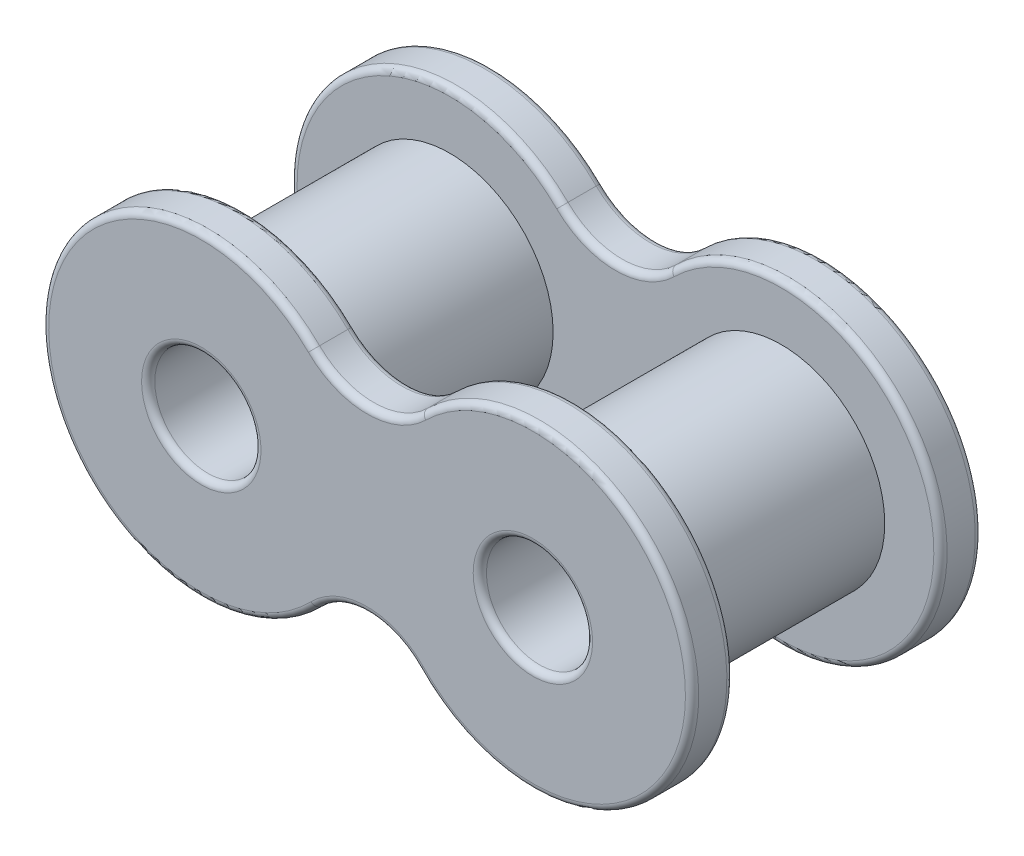
ISO-10303-21;
HEADER;
FILE_DESCRIPTION(('STEP AP214'),'2;1');
FILE_NAME('part.step','',(''),(''),'','','');
FILE_SCHEMA(('AUTOMOTIVE_DESIGN { 1 0 10303 214 1 1 1 1 }'));
ENDSEC;
DATA;
#1=APPLICATION_CONTEXT('core data for automotive mechanical design processes');
#2=APPLICATION_PROTOCOL_DEFINITION('international standard','automotive_design',2000,#1);
#3=PRODUCT_CONTEXT('',#1,'mechanical');
#4=PRODUCT('Part','Part','',(#3));
#5=PRODUCT_RELATED_PRODUCT_CATEGORY('part','',(#4));
#6=PRODUCT_DEFINITION_FORMATION('','',#4);
#7=PRODUCT_DEFINITION_CONTEXT('part definition',#1,'design');
#8=PRODUCT_DEFINITION('design','',#6,#7);
#9=PRODUCT_DEFINITION_SHAPE('','',#8);
#10=(LENGTH_UNIT() NAMED_UNIT(*) SI_UNIT(.MILLI.,.METRE.));
#11=(NAMED_UNIT(*) PLANE_ANGLE_UNIT() SI_UNIT($,.RADIAN.));
#12=(NAMED_UNIT(*) SI_UNIT($,.STERADIAN.) SOLID_ANGLE_UNIT());
#13=UNCERTAINTY_MEASURE_WITH_UNIT(LENGTH_MEASURE(1.E-05),#10,'distance_accuracy_value','');
#14=(GEOMETRIC_REPRESENTATION_CONTEXT(3) GLOBAL_UNCERTAINTY_ASSIGNED_CONTEXT((#13)) GLOBAL_UNIT_ASSIGNED_CONTEXT((#10,
#11,#12)) REPRESENTATION_CONTEXT('',''));
#15=CARTESIAN_POINT('',(0.,0.,0.));
#16=DIRECTION('',(0.,0.,1.));
#17=DIRECTION('',(1.,0.,0.));
#18=AXIS2_PLACEMENT_3D('',#15,#16,#17);
#19=CARTESIAN_POINT('',(3.175,3.22195909555123,1.5875));
#20=DIRECTION('',(0.,0.,1.));
#21=DIRECTION('',(1.,0.,0.));
#22=AXIS2_PLACEMENT_3D('',#19,#20,#21);
#23=PLANE('',#22);
#24=CARTESIAN_POINT('',(6.35,0.,1.5875));
#25=DIRECTION('',(0.,0.,1.));
#26=DIRECTION('',(1.,0.,0.));
#27=AXIS2_PLACEMENT_3D('',#24,#25,#26);
#28=CIRCLE('',#27,3.9624);
#29=CARTESIAN_POINT('',(10.3124,0.,1.5875));
#30=VERTEX_POINT('',#29);
#31=EDGE_CURVE('E232',#30,#30,#28,.T.);
#32=ORIENTED_EDGE('',*,*,#31,.F.);
#33=EDGE_LOOP('',(#32));
#34=FACE_BOUND('',#33,.T.);
#35=CARTESIAN_POINT('',(-6.35,0.,1.5875));
#36=DIRECTION('',(0.,0.,1.));
#37=DIRECTION('',(1.,0.,0.));
#38=AXIS2_PLACEMENT_3D('',#35,#36,#37);
#39=CIRCLE('',#38,3.9624);
#40=CARTESIAN_POINT('',(-2.3876,0.,1.5875));
#41=VERTEX_POINT('',#40);
#42=EDGE_CURVE('E242',#41,#41,#39,.T.);
#43=ORIENTED_EDGE('',*,*,#42,.F.);
#44=EDGE_LOOP('',(#43));
#45=FACE_BOUND('',#44,.T.);
#46=CARTESIAN_POINT('',(0.,-6.14159538924245,1.5875));
#47=DIRECTION('',(0.,0.,1.));
#48=DIRECTION('',(1.,0.,0.));
#49=AXIS2_PLACEMENT_3D('',#46,#47,#48);
#50=CIRCLE('',#49,2.99212100467071);
#51=CARTESIAN_POINT('',(-2.15074803363159,-4.0614340968371,1.5875));
#52=VERTEX_POINT('',#51);
#53=CARTESIAN_POINT('',(2.15074803363158,-4.0614340968371,1.5875));
#54=VERTEX_POINT('',#53);
#55=EDGE_CURVE('E224',#52,#54,#50,.F.);
#56=ORIENTED_EDGE('',*,*,#55,.T.);
#57=CARTESIAN_POINT('',(6.35,0.,1.5875));
#58=DIRECTION('',(0.,0.,1.));
#59=DIRECTION('',(1.,0.,0.));
#60=AXIS2_PLACEMENT_3D('',#57,#58,#59);
#61=CIRCLE('',#60,5.842);
#62=CARTESIAN_POINT('',(2.24951710037316,4.16113013373385,1.5875));
#63=VERTEX_POINT('',#62);
#64=EDGE_CURVE('E226',#54,#63,#61,.T.);
#65=ORIENTED_EDGE('',*,*,#64,.T.);
#66=CARTESIAN_POINT('',(0.,6.44391819110247,1.5875));
#67=DIRECTION('',(0.,0.,1.));
#68=DIRECTION('',(1.,0.,0.));
#69=AXIS2_PLACEMENT_3D('',#66,#67,#68);
#70=CIRCLE('',#69,3.20491006109939);
#71=CARTESIAN_POINT('',(-2.24951710037316,4.16113013373385,1.5875));
#72=VERTEX_POINT('',#71);
#73=EDGE_CURVE('E220',#63,#72,#70,.F.);
#74=ORIENTED_EDGE('',*,*,#73,.T.);
#75=CARTESIAN_POINT('',(-6.35,0.,1.5875));
#76=DIRECTION('',(0.,0.,1.));
#77=DIRECTION('',(1.,0.,0.));
#78=AXIS2_PLACEMENT_3D('',#75,#76,#77);
#79=CIRCLE('',#78,5.842);
#80=EDGE_CURVE('E222',#72,#52,#79,.T.);
#81=ORIENTED_EDGE('',*,*,#80,.T.);
#82=EDGE_LOOP('',(#56,#65,#74,#81));
#83=FACE_BOUND('',#82,.T.);
#84=ADVANCED_FACE('F37',(#34,#45,#83),#23,.T.);
#85=CARTESIAN_POINT('',(3.175,3.22195909555123,0.));
#86=DIRECTION('',(0.,0.,1.));
#87=DIRECTION('',(1.,0.,0.));
#88=AXIS2_PLACEMENT_3D('',#85,#86,#87);
#89=PLANE('',#88);
#90=CARTESIAN_POINT('',(6.35,0.,0.));
#91=DIRECTION('',(0.,0.,1.));
#92=DIRECTION('',(1.,0.,0.));
#93=AXIS2_PLACEMENT_3D('',#90,#91,#92);
#94=CIRCLE('',#93,2.286);
#95=CARTESIAN_POINT('',(8.636,0.,0.));
#96=VERTEX_POINT('',#95);
#97=EDGE_CURVE('E182',#96,#96,#94,.T.);
#98=ORIENTED_EDGE('',*,*,#97,.T.);
#99=EDGE_LOOP('',(#98));
#100=FACE_BOUND('',#99,.T.);
#101=CARTESIAN_POINT('',(-6.35,0.,0.));
#102=DIRECTION('',(0.,0.,1.));
#103=DIRECTION('',(1.,0.,0.));
#104=AXIS2_PLACEMENT_3D('',#101,#102,#103);
#105=CIRCLE('',#104,2.286);
#106=CARTESIAN_POINT('',(-4.064,0.,0.));
#107=VERTEX_POINT('',#106);
#108=EDGE_CURVE('E179',#107,#107,#105,.T.);
#109=ORIENTED_EDGE('',*,*,#108,.T.);
#110=EDGE_LOOP('',(#109));
#111=FACE_BOUND('',#110,.T.);
#112=CARTESIAN_POINT('',(0.,-6.14159538924245,0.));
#113=DIRECTION('',(0.,0.,1.));
#114=DIRECTION('',(1.,0.,0.));
#115=AXIS2_PLACEMENT_3D('',#112,#113,#114);
#116=CIRCLE('',#115,2.99212100467071);
#117=CARTESIAN_POINT('',(2.15074803363158,-4.0614340968371,0.));
#118=VERTEX_POINT('',#117);
#119=CARTESIAN_POINT('',(-2.15074803363158,-4.0614340968371,0.));
#120=VERTEX_POINT('',#119);
#121=EDGE_CURVE('E178',#118,#120,#116,.T.);
#122=ORIENTED_EDGE('',*,*,#121,.T.);
#123=CARTESIAN_POINT('',(-6.35,0.,0.));
#124=DIRECTION('',(0.,0.,1.));
#125=DIRECTION('',(1.,0.,0.));
#126=AXIS2_PLACEMENT_3D('',#123,#124,#125);
#127=CIRCLE('',#126,5.842);
#128=CARTESIAN_POINT('',(-2.24951710037316,4.16113013373385,0.));
#129=VERTEX_POINT('',#128);
#130=EDGE_CURVE('E157',#120,#129,#127,.F.);
#131=ORIENTED_EDGE('',*,*,#130,.T.);
#132=CARTESIAN_POINT('',(0.,6.44391819110247,0.));
#133=DIRECTION('',(0.,0.,1.));
#134=DIRECTION('',(1.,0.,0.));
#135=AXIS2_PLACEMENT_3D('',#132,#133,#134);
#136=CIRCLE('',#135,3.20491006109939);
#137=CARTESIAN_POINT('',(2.24951710037316,4.16113013373385,0.));
#138=VERTEX_POINT('',#137);
#139=EDGE_CURVE('E167',#129,#138,#136,.T.);
#140=ORIENTED_EDGE('',*,*,#139,.T.);
#141=CARTESIAN_POINT('',(6.35,0.,0.));
#142=DIRECTION('',(0.,0.,1.));
#143=DIRECTION('',(1.,0.,0.));
#144=AXIS2_PLACEMENT_3D('',#141,#142,#143);
#145=CIRCLE('',#144,5.842);
#146=EDGE_CURVE('E173',#138,#118,#145,.F.);
#147=ORIENTED_EDGE('',*,*,#146,.T.);
#148=EDGE_LOOP('',(#122,#131,#140,#147));
#149=FACE_BOUND('',#148,.T.);
#150=ADVANCED_FACE('F176',(#100,#111,#149),#89,.F.);
#151=CARTESIAN_POINT('',(0.,6.44391819110247,1.5875));
#152=DIRECTION('',(0.,0.,-1.));
#153=DIRECTION('',(-1.,0.,0.));
#154=AXIS2_PLACEMENT_3D('',#151,#152,#153);
#155=CYLINDRICAL_SURFACE('',#154,2.95091006109939);
#156=DIRECTION('',(0.,0.,-1.));
#157=VECTOR('',#156,1.);
#158=CARTESIAN_POINT('',(2.071235235172,4.34204883520054,1.5875));
#159=LINE('',#158,#157);
#160=CARTESIAN_POINT('',(2.071235235172,4.34204883520054,1.3335));
#161=VERTEX_POINT('',#160);
#162=CARTESIAN_POINT('',(2.071235235172,4.34204883520054,0.254));
#163=VERTEX_POINT('',#162);
#164=EDGE_CURVE('E238',#161,#163,#159,.T.);
#165=ORIENTED_EDGE('',*,*,#164,.T.);
#166=CARTESIAN_POINT('',(0.,6.44391819110247,0.254));
#167=DIRECTION('',(0.,0.,1.));
#168=DIRECTION('',(1.,0.,0.));
#169=AXIS2_PLACEMENT_3D('',#166,#167,#168);
#170=CIRCLE('',#169,2.95091006109939);
#171=CARTESIAN_POINT('',(-2.071235235172,4.34204883520054,0.254));
#172=VERTEX_POINT('',#171);
#173=EDGE_CURVE('E215',#163,#172,#170,.F.);
#174=ORIENTED_EDGE('',*,*,#173,.T.);
#175=DIRECTION('',(0.,0.,-1.));
#176=VECTOR('',#175,1.);
#177=CARTESIAN_POINT('',(-2.071235235172,4.34204883520054,1.5875));
#178=LINE('',#177,#176);
#179=CARTESIAN_POINT('',(-2.071235235172,4.34204883520054,1.3335));
#180=VERTEX_POINT('',#179);
#181=EDGE_CURVE('E174',#180,#172,#178,.T.);
#182=ORIENTED_EDGE('',*,*,#181,.F.);
#183=CARTESIAN_POINT('',(0.,6.44391819110247,1.3335));
#184=DIRECTION('',(0.,0.,1.));
#185=DIRECTION('',(1.,0.,0.));
#186=AXIS2_PLACEMENT_3D('',#183,#184,#185);
#187=CIRCLE('',#186,2.95091006109939);
#188=EDGE_CURVE('E213',#180,#161,#187,.T.);
#189=ORIENTED_EDGE('',*,*,#188,.T.);
#190=EDGE_LOOP('',(#165,#174,#182,#189));
#191=FACE_BOUND('',#190,.T.);
#192=ADVANCED_FACE('F360',(#191),#155,.F.);
#193=CARTESIAN_POINT('',(-6.35,0.,1.5875));
#194=DIRECTION('',(0.,0.,-1.));
#195=DIRECTION('',(-1.,0.,0.));
#196=AXIS2_PLACEMENT_3D('',#193,#194,#195);
#197=CYLINDRICAL_SURFACE('',#196,6.096);
#198=ORIENTED_EDGE('',*,*,#181,.T.);
#199=CARTESIAN_POINT('',(-6.35,0.,0.254));
#200=DIRECTION('',(0.,0.,1.));
#201=DIRECTION('',(1.,0.,0.));
#202=AXIS2_PLACEMENT_3D('',#199,#200,#201);
#203=CIRCLE('',#202,6.096);
#204=CARTESIAN_POINT('',(-1.96817186118078,-4.23801818800393,0.254));
#205=VERTEX_POINT('',#204);
#206=EDGE_CURVE('E160',#172,#205,#203,.T.);
#207=ORIENTED_EDGE('',*,*,#206,.T.);
#208=DIRECTION('',(0.,0.,-1.));
#209=VECTOR('',#208,1.);
#210=CARTESIAN_POINT('',(-1.96817186118078,-4.23801818800393,1.5875));
#211=LINE('',#210,#209);
#212=CARTESIAN_POINT('',(-1.96817186118078,-4.23801818800393,1.3335));
#213=VERTEX_POINT('',#212);
#214=EDGE_CURVE('E756',#213,#205,#211,.T.);
#215=ORIENTED_EDGE('',*,*,#214,.F.);
#216=CARTESIAN_POINT('',(-6.35,0.,1.3335));
#217=DIRECTION('',(0.,0.,1.));
#218=DIRECTION('',(1.,0.,0.));
#219=AXIS2_PLACEMENT_3D('',#216,#217,#218);
#220=CIRCLE('',#219,6.096);
#221=EDGE_CURVE('E201',#213,#180,#220,.F.);
#222=ORIENTED_EDGE('',*,*,#221,.T.);
#223=EDGE_LOOP('',(#198,#207,#215,#222));
#224=FACE_BOUND('',#223,.T.);
#225=ADVANCED_FACE('F376',(#224),#197,.T.);
#226=CARTESIAN_POINT('',(0.,-6.14159538924245,1.5875));
#227=DIRECTION('',(0.,0.,-1.));
#228=DIRECTION('',(-1.,0.,0.));
#229=AXIS2_PLACEMENT_3D('',#226,#227,#228);
#230=CYLINDRICAL_SURFACE('',#229,2.73812100467071);
#231=ORIENTED_EDGE('',*,*,#214,.T.);
#232=CARTESIAN_POINT('',(0.,-6.14159538924245,0.254));
#233=DIRECTION('',(0.,0.,1.));
#234=DIRECTION('',(1.,0.,0.));
#235=AXIS2_PLACEMENT_3D('',#232,#233,#234);
#236=CIRCLE('',#235,2.73812100467071);
#237=CARTESIAN_POINT('',(1.96817186118078,-4.23801818800393,0.254));
#238=VERTEX_POINT('',#237);
#239=EDGE_CURVE('E206',#205,#238,#236,.F.);
#240=ORIENTED_EDGE('',*,*,#239,.T.);
#241=DIRECTION('',(0.,0.,-1.));
#242=VECTOR('',#241,1.);
#243=CARTESIAN_POINT('',(1.96817186118078,-4.23801818800393,1.5875));
#244=LINE('',#243,#242);
#245=CARTESIAN_POINT('',(1.96817186118078,-4.23801818800393,1.3335));
#246=VERTEX_POINT('',#245);
#247=EDGE_CURVE('E753',#246,#238,#244,.T.);
#248=ORIENTED_EDGE('',*,*,#247,.F.);
#249=CARTESIAN_POINT('',(0.,-6.14159538924245,1.3335));
#250=DIRECTION('',(0.,0.,1.));
#251=DIRECTION('',(1.,0.,0.));
#252=AXIS2_PLACEMENT_3D('',#249,#250,#251);
#253=CIRCLE('',#252,2.73812100467071);
#254=EDGE_CURVE('E204',#246,#213,#253,.T.);
#255=ORIENTED_EDGE('',*,*,#254,.T.);
#256=EDGE_LOOP('',(#231,#240,#248,#255));
#257=FACE_BOUND('',#256,.T.);
#258=ADVANCED_FACE('F372',(#257),#230,.F.);
#259=CARTESIAN_POINT('',(6.35,0.,1.5875));
#260=DIRECTION('',(0.,0.,-1.));
#261=DIRECTION('',(-1.,0.,0.));
#262=AXIS2_PLACEMENT_3D('',#259,#260,#261);
#263=CYLINDRICAL_SURFACE('',#262,6.096);
#264=ORIENTED_EDGE('',*,*,#247,.T.);
#265=CARTESIAN_POINT('',(6.35,0.,0.254));
#266=DIRECTION('',(0.,0.,1.));
#267=DIRECTION('',(1.,0.,0.));
#268=AXIS2_PLACEMENT_3D('',#265,#266,#267);
#269=CIRCLE('',#268,6.096);
#270=EDGE_CURVE('E211',#238,#163,#269,.T.);
#271=ORIENTED_EDGE('',*,*,#270,.T.);
#272=ORIENTED_EDGE('',*,*,#164,.F.);
#273=CARTESIAN_POINT('',(6.35,0.,1.3335));
#274=DIRECTION('',(0.,0.,1.));
#275=DIRECTION('',(1.,0.,0.));
#276=AXIS2_PLACEMENT_3D('',#273,#274,#275);
#277=CIRCLE('',#276,6.096);
#278=EDGE_CURVE('E208',#161,#246,#277,.F.);
#279=ORIENTED_EDGE('',*,*,#278,.T.);
#280=EDGE_LOOP('',(#264,#271,#272,#279));
#281=FACE_BOUND('',#280,.T.);
#282=ADVANCED_FACE('F369',(#281),#263,.T.);
#283=CARTESIAN_POINT('',(-6.35,0.,1.5875));
#284=DIRECTION('',(0.,0.,-1.));
#285=DIRECTION('',(-1.,0.,0.));
#286=AXIS2_PLACEMENT_3D('',#283,#284,#285);
#287=CYLINDRICAL_SURFACE('',#286,2.032);
#288=CARTESIAN_POINT('',(-6.35,0.,0.254));
#289=DIRECTION('',(0.,0.,1.));
#290=DIRECTION('',(1.,0.,0.));
#291=AXIS2_PLACEMENT_3D('',#288,#289,#290);
#292=CIRCLE('',#291,2.032);
#293=CARTESIAN_POINT('',(-4.318,0.,0.254));
#294=VERTEX_POINT('',#293);
#295=EDGE_CURVE('E198',#294,#294,#292,.F.);
#296=ORIENTED_EDGE('',*,*,#295,.T.);
#297=EDGE_LOOP('',(#296));
#298=FACE_BOUND('',#297,.T.);
#299=CARTESIAN_POINT('',(-6.35,0.,1.3335));
#300=DIRECTION('',(0.,0.,1.));
#301=DIRECTION('',(1.,0.,0.));
#302=AXIS2_PLACEMENT_3D('',#299,#300,#301);
#303=CIRCLE('',#302,2.032);
#304=CARTESIAN_POINT('',(-4.318,0.,1.3335));
#305=VERTEX_POINT('',#304);
#306=EDGE_CURVE('E195',#305,#305,#303,.T.);
#307=ORIENTED_EDGE('',*,*,#306,.T.);
#308=EDGE_LOOP('',(#307));
#309=FACE_BOUND('',#308,.T.);
#310=ADVANCED_FACE('F366',(#298,#309),#287,.F.);
#311=CARTESIAN_POINT('',(6.35,0.,1.5875));
#312=DIRECTION('',(0.,0.,-1.));
#313=DIRECTION('',(-1.,0.,0.));
#314=AXIS2_PLACEMENT_3D('',#311,#312,#313);
#315=CYLINDRICAL_SURFACE('',#314,2.032);
#316=CARTESIAN_POINT('',(6.35,0.,0.254));
#317=DIRECTION('',(0.,0.,1.));
#318=DIRECTION('',(1.,0.,0.));
#319=AXIS2_PLACEMENT_3D('',#316,#317,#318);
#320=CIRCLE('',#319,2.032);
#321=CARTESIAN_POINT('',(8.382,0.,0.254));
#322=VERTEX_POINT('',#321);
#323=EDGE_CURVE('E192',#322,#322,#320,.F.);
#324=ORIENTED_EDGE('',*,*,#323,.T.);
#325=EDGE_LOOP('',(#324));
#326=FACE_BOUND('',#325,.T.);
#327=CARTESIAN_POINT('',(6.35,0.,1.3335));
#328=DIRECTION('',(0.,0.,1.));
#329=DIRECTION('',(1.,0.,0.));
#330=AXIS2_PLACEMENT_3D('',#327,#328,#329);
#331=CIRCLE('',#330,2.032);
#332=CARTESIAN_POINT('',(8.382,0.,1.3335));
#333=VERTEX_POINT('',#332);
#334=EDGE_CURVE('E189',#333,#333,#331,.T.);
#335=ORIENTED_EDGE('',*,*,#334,.T.);
#336=EDGE_LOOP('',(#335));
#337=FACE_BOUND('',#336,.T.);
#338=ADVANCED_FACE('F388',(#326,#337),#315,.F.);
#339=CARTESIAN_POINT('',(6.35,0.,0.254));
#340=DIRECTION('',(0.,0.,1.));
#341=DIRECTION('',(1.,0.,0.));
#342=AXIS2_PLACEMENT_3D('',#339,#340,#341);
#343=TOROIDAL_SURFACE('',#342,2.286,0.254);
#344=ORIENTED_EDGE('',*,*,#323,.F.);
#345=EDGE_LOOP('',(#344));
#346=FACE_BOUND('',#345,.T.);
#347=ORIENTED_EDGE('',*,*,#97,.F.);
#348=EDGE_LOOP('',(#347));
#349=FACE_BOUND('',#348,.T.);
#350=ADVANCED_FACE('F384',(#346,#349),#343,.T.);
#351=CARTESIAN_POINT('',(-6.35,0.,0.254));
#352=DIRECTION('',(0.,0.,1.));
#353=DIRECTION('',(1.,0.,0.));
#354=AXIS2_PLACEMENT_3D('',#351,#352,#353);
#355=TOROIDAL_SURFACE('',#354,2.286,0.254);
#356=ORIENTED_EDGE('',*,*,#295,.F.);
#357=EDGE_LOOP('',(#356));
#358=FACE_BOUND('',#357,.T.);
#359=ORIENTED_EDGE('',*,*,#108,.F.);
#360=EDGE_LOOP('',(#359));
#361=FACE_BOUND('',#360,.T.);
#362=ADVANCED_FACE('F387',(#358,#361),#355,.T.);
#363=CARTESIAN_POINT('',(6.35,0.,0.254));
#364=DIRECTION('',(0.,0.,1.));
#365=DIRECTION('',(1.,0.,0.));
#366=AXIS2_PLACEMENT_3D('',#363,#364,#365);
#367=TOROIDAL_SURFACE('',#366,5.842,0.254);
#368=CARTESIAN_POINT('',(2.15074803363158,-4.0614340968371,0.254));
#369=DIRECTION('',(-0.695212957349725,0.71880382854646,0.));
#370=DIRECTION('',(-0.71880382854646,-0.695212957349725,0.));
#371=AXIS2_PLACEMENT_3D('',#368,#369,#370);
#372=CIRCLE('',#371,0.254);
#373=EDGE_CURVE('E163',#118,#238,#372,.T.);
#374=ORIENTED_EDGE('',*,*,#373,.F.);
#375=ORIENTED_EDGE('',*,*,#146,.F.);
#376=CARTESIAN_POINT('',(2.24951710037316,4.16113013373385,0.254));
#377=DIRECTION('',(-0.71227835223106,-0.701897107091208,0.));
#378=DIRECTION('',(0.701897107091208,-0.71227835223106,0.));
#379=AXIS2_PLACEMENT_3D('',#376,#377,#378);
#380=CIRCLE('',#379,0.254);
#381=EDGE_CURVE('E170',#163,#138,#380,.T.);
#382=ORIENTED_EDGE('',*,*,#381,.F.);
#383=ORIENTED_EDGE('',*,*,#270,.F.);
#384=EDGE_LOOP('',(#374,#375,#382,#383));
#385=FACE_BOUND('',#384,.T.);
#386=ADVANCED_FACE('F392',(#385),#367,.T.);
#387=CARTESIAN_POINT('',(0.,6.44391819110247,0.254));
#388=DIRECTION('',(0.,0.,1.));
#389=DIRECTION('',(1.,0.,0.));
#390=AXIS2_PLACEMENT_3D('',#387,#388,#389);
#391=TOROIDAL_SURFACE('',#390,3.20491006109939,0.254);
#392=ORIENTED_EDGE('',*,*,#381,.T.);
#393=ORIENTED_EDGE('',*,*,#139,.F.);
#394=CARTESIAN_POINT('',(-2.24951710037316,4.16113013373385,0.254));
#395=DIRECTION('',(-0.71227835223106,0.701897107091208,0.));
#396=DIRECTION('',(-0.701897107091208,-0.71227835223106,0.));
#397=AXIS2_PLACEMENT_3D('',#394,#395,#396);
#398=CIRCLE('',#397,0.254);
#399=EDGE_CURVE('E153',#172,#129,#398,.T.);
#400=ORIENTED_EDGE('',*,*,#399,.F.);
#401=ORIENTED_EDGE('',*,*,#173,.F.);
#402=EDGE_LOOP('',(#392,#393,#400,#401));
#403=FACE_BOUND('',#402,.T.);
#404=ADVANCED_FACE('F168',(#403),#391,.T.);
#405=CARTESIAN_POINT('',(0.,-6.14159538924245,0.254));
#406=DIRECTION('',(0.,0.,1.));
#407=DIRECTION('',(1.,0.,0.));
#408=AXIS2_PLACEMENT_3D('',#405,#406,#407);
#409=TOROIDAL_SURFACE('',#408,2.99212100467071,0.254);
#410=ORIENTED_EDGE('',*,*,#373,.T.);
#411=ORIENTED_EDGE('',*,*,#239,.F.);
#412=CARTESIAN_POINT('',(-2.15074803363158,-4.0614340968371,0.254));
#413=DIRECTION('',(-0.695212957349727,-0.718803828546459,0.));
#414=DIRECTION('',(0.718803828546459,-0.695212957349727,0.));
#415=AXIS2_PLACEMENT_3D('',#412,#413,#414);
#416=CIRCLE('',#415,0.254);
#417=EDGE_CURVE('E164',#120,#205,#416,.T.);
#418=ORIENTED_EDGE('',*,*,#417,.F.);
#419=ORIENTED_EDGE('',*,*,#121,.F.);
#420=EDGE_LOOP('',(#410,#411,#418,#419));
#421=FACE_BOUND('',#420,.T.);
#422=ADVANCED_FACE('F397',(#421),#409,.T.);
#423=CARTESIAN_POINT('',(-6.35,0.,0.254));
#424=DIRECTION('',(0.,0.,1.));
#425=DIRECTION('',(1.,0.,0.));
#426=AXIS2_PLACEMENT_3D('',#423,#424,#425);
#427=TOROIDAL_SURFACE('',#426,5.842,0.254);
#428=ORIENTED_EDGE('',*,*,#399,.T.);
#429=ORIENTED_EDGE('',*,*,#130,.F.);
#430=ORIENTED_EDGE('',*,*,#417,.T.);
#431=ORIENTED_EDGE('',*,*,#206,.F.);
#432=EDGE_LOOP('',(#428,#429,#430,#431));
#433=FACE_BOUND('',#432,.T.);
#434=ADVANCED_FACE('F155',(#433),#427,.T.);
#435=CARTESIAN_POINT('',(6.35,0.,1.3335));
#436=DIRECTION('',(0.,0.,1.));
#437=DIRECTION('',(1.,0.,0.));
#438=AXIS2_PLACEMENT_3D('',#435,#436,#437);
#439=TOROIDAL_SURFACE('',#438,2.286,0.254);
#440=CARTESIAN_POINT('',(6.35,0.,1.5875));
#441=DIRECTION('',(0.,0.,1.));
#442=DIRECTION('',(1.,0.,0.));
#443=AXIS2_PLACEMENT_3D('',#440,#441,#442);
#444=CIRCLE('',#443,2.286);
#445=CARTESIAN_POINT('',(8.636,0.,1.5875));
#446=VERTEX_POINT('',#445);
#447=EDGE_CURVE('E229',#446,#446,#444,.F.);
#448=ORIENTED_EDGE('',*,*,#447,.F.);
#449=EDGE_LOOP('',(#448));
#450=FACE_BOUND('',#449,.T.);
#451=ORIENTED_EDGE('',*,*,#334,.F.);
#452=EDGE_LOOP('',(#451));
#453=FACE_BOUND('',#452,.T.);
#454=ADVANCED_FACE('F396',(#450,#453),#439,.T.);
#455=CARTESIAN_POINT('',(-6.35,0.,1.3335));
#456=DIRECTION('',(0.,0.,1.));
#457=DIRECTION('',(1.,0.,0.));
#458=AXIS2_PLACEMENT_3D('',#455,#456,#457);
#459=TOROIDAL_SURFACE('',#458,5.842,0.254);
#460=CARTESIAN_POINT('',(-2.24951710037316,4.16113013373385,1.3335));
#461=DIRECTION('',(0.712278352231059,-0.701897107091209,0.));
#462=DIRECTION('',(0.701897107091209,0.712278352231059,0.));
#463=AXIS2_PLACEMENT_3D('',#460,#461,#462);
#464=CIRCLE('',#463,0.254);
#465=EDGE_CURVE('E244',#180,#72,#464,.T.);
#466=ORIENTED_EDGE('',*,*,#465,.F.);
#467=ORIENTED_EDGE('',*,*,#221,.F.);
#468=CARTESIAN_POINT('',(-2.15074803363159,-4.0614340968371,1.3335));
#469=DIRECTION('',(0.695212957349723,0.718803828546462,0.));
#470=DIRECTION('',(-0.718803828546462,0.695212957349724,0.));
#471=AXIS2_PLACEMENT_3D('',#468,#469,#470);
#472=CIRCLE('',#471,0.254);
#473=EDGE_CURVE('E233',#52,#213,#472,.T.);
#474=ORIENTED_EDGE('',*,*,#473,.F.);
#475=ORIENTED_EDGE('',*,*,#80,.F.);
#476=EDGE_LOOP('',(#466,#467,#474,#475));
#477=FACE_BOUND('',#476,.T.);
#478=ADVANCED_FACE('F408',(#477),#459,.T.);
#479=CARTESIAN_POINT('',(0.,-6.14159538924245,1.3335));
#480=DIRECTION('',(0.,0.,1.));
#481=DIRECTION('',(1.,0.,0.));
#482=AXIS2_PLACEMENT_3D('',#479,#480,#481);
#483=TOROIDAL_SURFACE('',#482,2.99212100467071,0.254);
#484=ORIENTED_EDGE('',*,*,#473,.T.);
#485=ORIENTED_EDGE('',*,*,#254,.F.);
#486=CARTESIAN_POINT('',(2.15074803363158,-4.0614340968371,1.3335));
#487=DIRECTION('',(0.695212957349726,-0.718803828546459,0.));
#488=DIRECTION('',(0.718803828546459,0.695212957349726,0.));
#489=AXIS2_PLACEMENT_3D('',#486,#487,#488);
#490=CIRCLE('',#489,0.254);
#491=EDGE_CURVE('E241',#54,#246,#490,.T.);
#492=ORIENTED_EDGE('',*,*,#491,.F.);
#493=ORIENTED_EDGE('',*,*,#55,.F.);
#494=EDGE_LOOP('',(#484,#485,#492,#493));
#495=FACE_BOUND('',#494,.T.);
#496=ADVANCED_FACE('F418',(#495),#483,.T.);
#497=CARTESIAN_POINT('',(0.,6.44391819110247,1.3335));
#498=DIRECTION('',(0.,0.,1.));
#499=DIRECTION('',(1.,0.,0.));
#500=AXIS2_PLACEMENT_3D('',#497,#498,#499);
#501=TOROIDAL_SURFACE('',#500,3.20491006109939,0.254);
#502=ORIENTED_EDGE('',*,*,#465,.T.);
#503=ORIENTED_EDGE('',*,*,#73,.F.);
#504=CARTESIAN_POINT('',(2.24951710037317,4.16113013373385,1.3335));
#505=DIRECTION('',(0.712278352231059,0.701897107091209,0.));
#506=DIRECTION('',(-0.701897107091209,0.712278352231059,0.));
#507=AXIS2_PLACEMENT_3D('',#504,#505,#506);
#508=CIRCLE('',#507,0.254);
#509=EDGE_CURVE('E239',#161,#63,#508,.T.);
#510=ORIENTED_EDGE('',*,*,#509,.F.);
#511=ORIENTED_EDGE('',*,*,#188,.F.);
#512=EDGE_LOOP('',(#502,#503,#510,#511));
#513=FACE_BOUND('',#512,.T.);
#514=ADVANCED_FACE('F414',(#513),#501,.T.);
#515=CARTESIAN_POINT('',(6.35,0.,1.3335));
#516=DIRECTION('',(0.,0.,1.));
#517=DIRECTION('',(1.,0.,0.));
#518=AXIS2_PLACEMENT_3D('',#515,#516,#517);
#519=TOROIDAL_SURFACE('',#518,5.842,0.254);
#520=ORIENTED_EDGE('',*,*,#491,.T.);
#521=ORIENTED_EDGE('',*,*,#278,.F.);
#522=ORIENTED_EDGE('',*,*,#509,.T.);
#523=ORIENTED_EDGE('',*,*,#64,.F.);
#524=EDGE_LOOP('',(#520,#521,#522,#523));
#525=FACE_BOUND('',#524,.T.);
#526=ADVANCED_FACE('F410',(#525),#519,.T.);
#527=CARTESIAN_POINT('',(-6.35,0.,1.3335));
#528=DIRECTION('',(0.,0.,1.));
#529=DIRECTION('',(1.,0.,0.));
#530=AXIS2_PLACEMENT_3D('',#527,#528,#529);
#531=TOROIDAL_SURFACE('',#530,2.286,0.254);
#532=CARTESIAN_POINT('',(-6.35,0.,1.5875));
#533=DIRECTION('',(0.,0.,1.));
#534=DIRECTION('',(1.,0.,0.));
#535=AXIS2_PLACEMENT_3D('',#532,#533,#534);
#536=CIRCLE('',#535,2.286);
#537=CARTESIAN_POINT('',(-4.064,0.,1.5875));
#538=VERTEX_POINT('',#537);
#539=EDGE_CURVE('E217',#538,#538,#536,.F.);
#540=ORIENTED_EDGE('',*,*,#539,.F.);
#541=EDGE_LOOP('',(#540));
#542=FACE_BOUND('',#541,.T.);
#543=ORIENTED_EDGE('',*,*,#306,.F.);
#544=EDGE_LOOP('',(#543));
#545=FACE_BOUND('',#544,.T.);
#546=ADVANCED_FACE('F413',(#542,#545),#531,.T.);
#547=CARTESIAN_POINT('',(-6.35,0.,1.5875));
#548=DIRECTION('',(0.,0.,1.));
#549=DIRECTION('',(1.,0.,0.));
#550=AXIS2_PLACEMENT_3D('',#547,#548,#549);
#551=PLANE('',#550);
#552=CARTESIAN_POINT('',(-6.35,0.,1.5875));
#553=DIRECTION('',(0.,0.,1.));
#554=DIRECTION('',(1.,0.,0.));
#555=AXIS2_PLACEMENT_3D('',#552,#553,#554);
#556=CIRCLE('',#555,2.032);
#557=CARTESIAN_POINT('',(-4.318,0.,1.5875));
#558=VERTEX_POINT('',#557);
#559=EDGE_CURVE('E739',#558,#558,#556,.T.);
#560=ORIENTED_EDGE('',*,*,#559,.T.);
#561=EDGE_LOOP('',(#560));
#562=FACE_BOUND('',#561,.T.);
#563=ORIENTED_EDGE('',*,*,#539,.T.);
#564=EDGE_LOOP('',(#563));
#565=FACE_BOUND('',#564,.T.);
#566=ADVANCED_FACE('F428',(#562,#565),#551,.F.);
#567=CARTESIAN_POINT('',(-6.35,0.,9.5123));
#568=DIRECTION('',(0.,0.,-1.));
#569=DIRECTION('',(-1.,0.,0.));
#570=AXIS2_PLACEMENT_3D('',#567,#568,#569);
#571=CYLINDRICAL_SURFACE('',#570,3.9624);
#572=CARTESIAN_POINT('',(-6.35,0.,9.2583));
#573=DIRECTION('',(0.,0.,-1.));
#574=DIRECTION('',(-1.,0.,0.));
#575=AXIS2_PLACEMENT_3D('',#572,#573,#574);
#576=CIRCLE('',#575,3.9624);
#577=CARTESIAN_POINT('',(-10.3124,0.,9.2583));
#578=VERTEX_POINT('',#577);
#579=EDGE_CURVE('E46',#578,#578,#576,.T.);
#580=ORIENTED_EDGE('',*,*,#579,.T.);
#581=EDGE_LOOP('',(#580));
#582=FACE_BOUND('',#581,.T.);
#583=ORIENTED_EDGE('',*,*,#42,.T.);
#584=EDGE_LOOP('',(#583));
#585=FACE_BOUND('',#584,.T.);
#586=ADVANCED_FACE('F570',(#582,#585),#571,.T.);
#587=CARTESIAN_POINT('',(-6.35,0.,9.5123));
#588=DIRECTION('',(0.,0.,-1.));
#589=DIRECTION('',(-1.,0.,0.));
#590=AXIS2_PLACEMENT_3D('',#587,#588,#589);
#591=CYLINDRICAL_SURFACE('',#590,2.032);
#592=CARTESIAN_POINT('',(-6.35,0.,10.8458));
#593=DIRECTION('',(0.,0.,-1.));
#594=DIRECTION('',(-1.,0.,0.));
#595=AXIS2_PLACEMENT_3D('',#592,#593,#594);
#596=CIRCLE('',#595,2.032);
#597=CARTESIAN_POINT('',(-8.382,0.,10.8458));
#598=VERTEX_POINT('',#597);
#599=EDGE_CURVE('E284',#598,#598,#596,.F.);
#600=ORIENTED_EDGE('',*,*,#599,.T.);
#601=EDGE_LOOP('',(#600));
#602=FACE_BOUND('',#601,.T.);
#603=ORIENTED_EDGE('',*,*,#559,.F.);
#604=EDGE_LOOP('',(#603));
#605=FACE_BOUND('',#604,.T.);
#606=ADVANCED_FACE('F566',(#602,#605),#591,.F.);
#607=CARTESIAN_POINT('',(6.35,0.,1.5875));
#608=DIRECTION('',(0.,0.,1.));
#609=DIRECTION('',(-1.,0.,0.));
#610=AXIS2_PLACEMENT_3D('',#607,#608,#609);
#611=PLANE('',#610);
#612=CARTESIAN_POINT('',(6.35,0.,1.5875));
#613=DIRECTION('',(0.,0.,-1.));
#614=DIRECTION('',(-1.,0.,0.));
#615=AXIS2_PLACEMENT_3D('',#612,#613,#614);
#616=CIRCLE('',#615,2.032);
#617=CARTESIAN_POINT('',(4.318,0.,1.5875));
#618=VERTEX_POINT('',#617);
#619=EDGE_CURVE('E742',#618,#618,#616,.T.);
#620=ORIENTED_EDGE('',*,*,#619,.F.);
#621=EDGE_LOOP('',(#620));
#622=FACE_BOUND('',#621,.T.);
#623=ORIENTED_EDGE('',*,*,#447,.T.);
#624=EDGE_LOOP('',(#623));
#625=FACE_BOUND('',#624,.T.);
#626=ADVANCED_FACE('F558',(#622,#625),#611,.F.);
#627=CARTESIAN_POINT('',(6.35,0.,9.5123));
#628=DIRECTION('',(0.,0.,-1.));
#629=DIRECTION('',(-1.,0.,0.));
#630=AXIS2_PLACEMENT_3D('',#627,#628,#629);
#631=CYLINDRICAL_SURFACE('',#630,3.9624);
#632=CARTESIAN_POINT('',(6.35,0.,9.2583));
#633=DIRECTION('',(0.,0.,-1.));
#634=DIRECTION('',(-1.,0.,0.));
#635=AXIS2_PLACEMENT_3D('',#632,#633,#634);
#636=CIRCLE('',#635,3.9624);
#637=CARTESIAN_POINT('',(2.3876,0.,9.2583));
#638=VERTEX_POINT('',#637);
#639=EDGE_CURVE('E11',#638,#638,#636,.T.);
#640=ORIENTED_EDGE('',*,*,#639,.T.);
#641=EDGE_LOOP('',(#640));
#642=FACE_BOUND('',#641,.T.);
#643=ORIENTED_EDGE('',*,*,#31,.T.);
#644=EDGE_LOOP('',(#643));
#645=FACE_BOUND('',#644,.T.);
#646=ADVANCED_FACE('F349',(#642,#645),#631,.T.);
#647=CARTESIAN_POINT('',(6.35,0.,9.5123));
#648=DIRECTION('',(0.,0.,-1.));
#649=DIRECTION('',(-1.,0.,0.));
#650=AXIS2_PLACEMENT_3D('',#647,#648,#649);
#651=CYLINDRICAL_SURFACE('',#650,2.032);
#652=CARTESIAN_POINT('',(6.35,0.,10.8458));
#653=DIRECTION('',(0.,0.,-1.));
#654=DIRECTION('',(-1.,0.,0.));
#655=AXIS2_PLACEMENT_3D('',#652,#653,#654);
#656=CIRCLE('',#655,2.032);
#657=CARTESIAN_POINT('',(4.318,0.,10.8458));
#658=VERTEX_POINT('',#657);
#659=EDGE_CURVE('E287',#658,#658,#656,.F.);
#660=ORIENTED_EDGE('',*,*,#659,.T.);
#661=EDGE_LOOP('',(#660));
#662=FACE_BOUND('',#661,.T.);
#663=ORIENTED_EDGE('',*,*,#619,.T.);
#664=EDGE_LOOP('',(#663));
#665=FACE_BOUND('',#664,.T.);
#666=ADVANCED_FACE('F339',(#662,#665),#651,.F.);
#667=CARTESIAN_POINT('',(3.175,3.22195909555123,9.5123));
#668=DIRECTION('',(0.,0.,-1.));
#669=DIRECTION('',(1.,0.,0.));
#670=AXIS2_PLACEMENT_3D('',#667,#668,#669);
#671=PLANE('',#670);
#672=CARTESIAN_POINT('',(-6.35,0.,9.5123));
#673=DIRECTION('',(0.,0.,-1.));
#674=DIRECTION('',(-1.,0.,0.));
#675=AXIS2_PLACEMENT_3D('',#672,#673,#674);
#676=CIRCLE('',#675,4.2164);
#677=CARTESIAN_POINT('',(-10.5664,0.,9.5123));
#678=VERTEX_POINT('',#677);
#679=EDGE_CURVE('E299',#678,#678,#676,.F.);
#680=ORIENTED_EDGE('',*,*,#679,.T.);
#681=EDGE_LOOP('',(#680));
#682=FACE_BOUND('',#681,.T.);
#683=CARTESIAN_POINT('',(6.35,0.,9.5123));
#684=DIRECTION('',(0.,0.,-1.));
#685=DIRECTION('',(-1.,0.,0.));
#686=AXIS2_PLACEMENT_3D('',#683,#684,#685);
#687=CIRCLE('',#686,4.2164);
#688=CARTESIAN_POINT('',(2.1336,0.,9.5123));
#689=VERTEX_POINT('',#688);
#690=EDGE_CURVE('E296',#689,#689,#687,.F.);
#691=ORIENTED_EDGE('',*,*,#690,.T.);
#692=EDGE_LOOP('',(#691));
#693=FACE_BOUND('',#692,.T.);
#694=CARTESIAN_POINT('',(0.,-6.14159538924245,9.5123));
#695=DIRECTION('',(0.,0.,-1.));
#696=DIRECTION('',(-1.,0.,0.));
#697=AXIS2_PLACEMENT_3D('',#694,#695,#696);
#698=CIRCLE('',#697,2.99212100467071);
#699=CARTESIAN_POINT('',(2.15074803363158,-4.0614340968371,9.5123));
#700=VERTEX_POINT('',#699);
#701=CARTESIAN_POINT('',(-2.15074803363158,-4.0614340968371,9.5123));
#702=VERTEX_POINT('',#701);
#703=EDGE_CURVE('E54',#700,#702,#698,.F.);
#704=ORIENTED_EDGE('',*,*,#703,.T.);
#705=CARTESIAN_POINT('',(-6.35,0.,9.5123));
#706=DIRECTION('',(0.,0.,-1.));
#707=DIRECTION('',(-1.,0.,0.));
#708=AXIS2_PLACEMENT_3D('',#705,#706,#707);
#709=CIRCLE('',#708,5.842);
#710=CARTESIAN_POINT('',(-2.24951710037316,4.16113013373385,9.5123));
#711=VERTEX_POINT('',#710);
#712=EDGE_CURVE('E294',#702,#711,#709,.T.);
#713=ORIENTED_EDGE('',*,*,#712,.T.);
#714=CARTESIAN_POINT('',(0.,6.44391819110247,9.5123));
#715=DIRECTION('',(0.,0.,-1.));
#716=DIRECTION('',(-1.,0.,0.));
#717=AXIS2_PLACEMENT_3D('',#714,#715,#716);
#718=CIRCLE('',#717,3.20491006109939);
#719=CARTESIAN_POINT('',(2.24951710037316,4.16113013373385,9.5123));
#720=VERTEX_POINT('',#719);
#721=EDGE_CURVE('E290',#711,#720,#718,.F.);
#722=ORIENTED_EDGE('',*,*,#721,.T.);
#723=CARTESIAN_POINT('',(6.35,0.,9.5123));
#724=DIRECTION('',(0.,0.,-1.));
#725=DIRECTION('',(-1.,0.,0.));
#726=AXIS2_PLACEMENT_3D('',#723,#724,#725);
#727=CIRCLE('',#726,5.842);
#728=EDGE_CURVE('E59',#720,#700,#727,.T.);
#729=ORIENTED_EDGE('',*,*,#728,.T.);
#730=EDGE_LOOP('',(#704,#713,#722,#729));
#731=FACE_BOUND('',#730,.T.);
#732=ADVANCED_FACE('F336',(#682,#693,#731),#671,.T.);
#733=CARTESIAN_POINT('',(0.,6.44391819110247,9.5123));
#734=DIRECTION('',(0.,0.,1.));
#735=DIRECTION('',(1.,0.,0.));
#736=AXIS2_PLACEMENT_3D('',#733,#734,#735);
#737=CYLINDRICAL_SURFACE('',#736,2.95091006109939);
#738=DIRECTION('',(0.,0.,1.));
#739=VECTOR('',#738,1.);
#740=CARTESIAN_POINT('',(-2.071235235172,4.34204883520054,9.5123));
#741=LINE('',#740,#739);
#742=CARTESIAN_POINT('',(-2.071235235172,4.34204883520054,9.7663));
#743=VERTEX_POINT('',#742);
#744=CARTESIAN_POINT('',(-2.071235235172,4.34204883520054,10.8458));
#745=VERTEX_POINT('',#744);
#746=EDGE_CURVE('E314',#743,#745,#741,.T.);
#747=ORIENTED_EDGE('',*,*,#746,.T.);
#748=CARTESIAN_POINT('',(0.,6.44391819110247,10.8458));
#749=DIRECTION('',(0.,0.,-1.));
#750=DIRECTION('',(-1.,0.,0.));
#751=AXIS2_PLACEMENT_3D('',#748,#749,#750);
#752=CIRCLE('',#751,2.95091006109939);
#753=CARTESIAN_POINT('',(2.071235235172,4.34204883520054,10.8458));
#754=VERTEX_POINT('',#753);
#755=EDGE_CURVE('E282',#745,#754,#752,.F.);
#756=ORIENTED_EDGE('',*,*,#755,.T.);
#757=DIRECTION('',(0.,0.,1.));
#758=VECTOR('',#757,1.);
#759=CARTESIAN_POINT('',(2.071235235172,4.34204883520054,9.5123));
#760=LINE('',#759,#758);
#761=CARTESIAN_POINT('',(2.071235235172,4.34204883520054,9.7663));
#762=VERTEX_POINT('',#761);
#763=EDGE_CURVE('E747',#762,#754,#760,.T.);
#764=ORIENTED_EDGE('',*,*,#763,.F.);
#765=CARTESIAN_POINT('',(0.,6.44391819110247,9.7663));
#766=DIRECTION('',(0.,0.,-1.));
#767=DIRECTION('',(-1.,0.,0.));
#768=AXIS2_PLACEMENT_3D('',#765,#766,#767);
#769=CIRCLE('',#768,2.95091006109939);
#770=EDGE_CURVE('E280',#762,#743,#769,.T.);
#771=ORIENTED_EDGE('',*,*,#770,.T.);
#772=EDGE_LOOP('',(#747,#756,#764,#771));
#773=FACE_BOUND('',#772,.T.);
#774=ADVANCED_FACE('F338',(#773),#737,.F.);
#775=CARTESIAN_POINT('',(6.35,0.,9.5123));
#776=DIRECTION('',(0.,0.,1.));
#777=DIRECTION('',(1.,0.,0.));
#778=AXIS2_PLACEMENT_3D('',#775,#776,#777);
#779=CYLINDRICAL_SURFACE('',#778,6.096);
#780=ORIENTED_EDGE('',*,*,#763,.T.);
#781=CARTESIAN_POINT('',(6.35,0.,10.8458));
#782=DIRECTION('',(0.,0.,-1.));
#783=DIRECTION('',(-1.,0.,0.));
#784=AXIS2_PLACEMENT_3D('',#781,#782,#783);
#785=CIRCLE('',#784,6.096);
#786=CARTESIAN_POINT('',(1.96817186118078,-4.23801818800393,10.8458));
#787=VERTEX_POINT('',#786);
#788=EDGE_CURVE('E268',#754,#787,#785,.T.);
#789=ORIENTED_EDGE('',*,*,#788,.T.);
#790=DIRECTION('',(0.,0.,1.));
#791=VECTOR('',#790,1.);
#792=CARTESIAN_POINT('',(1.96817186118078,-4.23801818800393,9.5123));
#793=LINE('',#792,#791);
#794=CARTESIAN_POINT('',(1.96817186118078,-4.23801818800393,9.7663));
#795=VERTEX_POINT('',#794);
#796=EDGE_CURVE('E782',#795,#787,#793,.T.);
#797=ORIENTED_EDGE('',*,*,#796,.F.);
#798=CARTESIAN_POINT('',(6.35,0.,9.7663));
#799=DIRECTION('',(0.,0.,-1.));
#800=DIRECTION('',(-1.,0.,0.));
#801=AXIS2_PLACEMENT_3D('',#798,#799,#800);
#802=CIRCLE('',#801,6.096);
#803=EDGE_CURVE('E266',#795,#762,#802,.F.);
#804=ORIENTED_EDGE('',*,*,#803,.T.);
#805=EDGE_LOOP('',(#780,#789,#797,#804));
#806=FACE_BOUND('',#805,.T.);
#807=ADVANCED_FACE('F346',(#806),#779,.T.);
#808=CARTESIAN_POINT('',(0.,-6.14159538924245,9.5123));
#809=DIRECTION('',(0.,0.,1.));
#810=DIRECTION('',(1.,0.,0.));
#811=AXIS2_PLACEMENT_3D('',#808,#809,#810);
#812=CYLINDRICAL_SURFACE('',#811,2.73812100467071);
#813=ORIENTED_EDGE('',*,*,#796,.T.);
#814=CARTESIAN_POINT('',(0.,-6.14159538924245,10.8458));
#815=DIRECTION('',(0.,0.,-1.));
#816=DIRECTION('',(-1.,0.,0.));
#817=AXIS2_PLACEMENT_3D('',#814,#815,#816);
#818=CIRCLE('',#817,2.73812100467071);
#819=CARTESIAN_POINT('',(-1.96817186118078,-4.23801818800393,10.8458));
#820=VERTEX_POINT('',#819);
#821=EDGE_CURVE('E273',#787,#820,#818,.F.);
#822=ORIENTED_EDGE('',*,*,#821,.T.);
#823=DIRECTION('',(0.,0.,1.));
#824=VECTOR('',#823,1.);
#825=CARTESIAN_POINT('',(-1.96817186118078,-4.23801818800393,9.5123));
#826=LINE('',#825,#824);
#827=CARTESIAN_POINT('',(-1.96817186118078,-4.23801818800393,9.7663));
#828=VERTEX_POINT('',#827);
#829=EDGE_CURVE('E785',#828,#820,#826,.T.);
#830=ORIENTED_EDGE('',*,*,#829,.F.);
#831=CARTESIAN_POINT('',(0.,-6.14159538924245,9.7663));
#832=DIRECTION('',(0.,0.,-1.));
#833=DIRECTION('',(-1.,0.,0.));
#834=AXIS2_PLACEMENT_3D('',#831,#832,#833);
#835=CIRCLE('',#834,2.73812100467071);
#836=EDGE_CURVE('E271',#828,#795,#835,.T.);
#837=ORIENTED_EDGE('',*,*,#836,.T.);
#838=EDGE_LOOP('',(#813,#822,#830,#837));
#839=FACE_BOUND('',#838,.T.);
#840=ADVANCED_FACE('F517',(#839),#812,.F.);
#841=CARTESIAN_POINT('',(-6.35,0.,9.5123));
#842=DIRECTION('',(0.,0.,1.));
#843=DIRECTION('',(1.,0.,0.));
#844=AXIS2_PLACEMENT_3D('',#841,#842,#843);
#845=CYLINDRICAL_SURFACE('',#844,6.096);
#846=ORIENTED_EDGE('',*,*,#829,.T.);
#847=CARTESIAN_POINT('',(-6.35,0.,10.8458));
#848=DIRECTION('',(0.,0.,-1.));
#849=DIRECTION('',(-1.,0.,0.));
#850=AXIS2_PLACEMENT_3D('',#847,#848,#849);
#851=CIRCLE('',#850,6.096);
#852=EDGE_CURVE('E278',#820,#745,#851,.T.);
#853=ORIENTED_EDGE('',*,*,#852,.T.);
#854=ORIENTED_EDGE('',*,*,#746,.F.);
#855=CARTESIAN_POINT('',(-6.35,0.,9.7663));
#856=DIRECTION('',(0.,0.,-1.));
#857=DIRECTION('',(-1.,0.,0.));
#858=AXIS2_PLACEMENT_3D('',#855,#856,#857);
#859=CIRCLE('',#858,6.096);
#860=EDGE_CURVE('E275',#743,#828,#859,.F.);
#861=ORIENTED_EDGE('',*,*,#860,.T.);
#862=EDGE_LOOP('',(#846,#853,#854,#861));
#863=FACE_BOUND('',#862,.T.);
#864=ADVANCED_FACE('F510',(#863),#845,.T.);
#865=CARTESIAN_POINT('',(3.175,3.22195909555123,11.0998));
#866=DIRECTION('',(0.,0.,-1.));
#867=DIRECTION('',(1.,0.,0.));
#868=AXIS2_PLACEMENT_3D('',#865,#866,#867);
#869=PLANE('',#868);
#870=CARTESIAN_POINT('',(0.,-6.14159538924245,11.0998));
#871=DIRECTION('',(0.,0.,-1.));
#872=DIRECTION('',(-1.,0.,0.));
#873=AXIS2_PLACEMENT_3D('',#870,#871,#872);
#874=CIRCLE('',#873,2.99212100467071);
#875=CARTESIAN_POINT('',(-2.15074803363159,-4.0614340968371,11.0998));
#876=VERTEX_POINT('',#875);
#877=CARTESIAN_POINT('',(2.15074803363158,-4.0614340968371,11.0998));
#878=VERTEX_POINT('',#877);
#879=EDGE_CURVE('E261',#876,#878,#874,.T.);
#880=ORIENTED_EDGE('',*,*,#879,.T.);
#881=CARTESIAN_POINT('',(6.35,0.,11.0998));
#882=DIRECTION('',(0.,0.,-1.));
#883=DIRECTION('',(-1.,0.,0.));
#884=AXIS2_PLACEMENT_3D('',#881,#882,#883);
#885=CIRCLE('',#884,5.842);
#886=CARTESIAN_POINT('',(2.24951710037316,4.16113013373385,11.0998));
#887=VERTEX_POINT('',#886);
#888=EDGE_CURVE('E263',#878,#887,#885,.F.);
#889=ORIENTED_EDGE('',*,*,#888,.T.);
#890=CARTESIAN_POINT('',(0.,6.44391819110247,11.0998));
#891=DIRECTION('',(0.,0.,-1.));
#892=DIRECTION('',(-1.,0.,0.));
#893=AXIS2_PLACEMENT_3D('',#890,#891,#892);
#894=CIRCLE('',#893,3.20491006109939);
#895=CARTESIAN_POINT('',(-2.24951710037316,4.16113013373385,11.0998));
#896=VERTEX_POINT('',#895);
#897=EDGE_CURVE('E257',#887,#896,#894,.T.);
#898=ORIENTED_EDGE('',*,*,#897,.T.);
#899=CARTESIAN_POINT('',(-6.35,0.,11.0998));
#900=DIRECTION('',(0.,0.,-1.));
#901=DIRECTION('',(-1.,0.,0.));
#902=AXIS2_PLACEMENT_3D('',#899,#900,#901);
#903=CIRCLE('',#902,5.842);
#904=EDGE_CURVE('E259',#896,#876,#903,.F.);
#905=ORIENTED_EDGE('',*,*,#904,.T.);
#906=EDGE_LOOP('',(#880,#889,#898,#905));
#907=FACE_BOUND('',#906,.T.);
#908=CARTESIAN_POINT('',(-6.35,0.,11.0998));
#909=DIRECTION('',(0.,0.,-1.));
#910=DIRECTION('',(-1.,0.,0.));
#911=AXIS2_PLACEMENT_3D('',#908,#909,#910);
#912=CIRCLE('',#911,2.286);
#913=CARTESIAN_POINT('',(-8.636,0.,11.0998));
#914=VERTEX_POINT('',#913);
#915=EDGE_CURVE('E254',#914,#914,#912,.T.);
#916=ORIENTED_EDGE('',*,*,#915,.T.);
#917=EDGE_LOOP('',(#916));
#918=FACE_BOUND('',#917,.T.);
#919=CARTESIAN_POINT('',(6.35,0.,11.0998));
#920=DIRECTION('',(0.,0.,-1.));
#921=DIRECTION('',(-1.,0.,0.));
#922=AXIS2_PLACEMENT_3D('',#919,#920,#921);
#923=CIRCLE('',#922,2.286);
#924=CARTESIAN_POINT('',(4.064,0.,11.0998));
#925=VERTEX_POINT('',#924);
#926=EDGE_CURVE('E251',#925,#925,#923,.T.);
#927=ORIENTED_EDGE('',*,*,#926,.T.);
#928=EDGE_LOOP('',(#927));
#929=FACE_BOUND('',#928,.T.);
#930=ADVANCED_FACE('F446',(#907,#918,#929),#869,.F.);
#931=CARTESIAN_POINT('',(-6.35,0.,10.8458));
#932=DIRECTION('',(0.,0.,-1.));
#933=DIRECTION('',(-1.,0.,0.));
#934=AXIS2_PLACEMENT_3D('',#931,#932,#933);
#935=TOROIDAL_SURFACE('',#934,5.842,0.254);
#936=CARTESIAN_POINT('',(-2.24951710037316,4.16113013373385,10.8458));
#937=DIRECTION('',(0.712278352231059,-0.701897107091209,0.));
#938=DIRECTION('',(0.701897107091209,0.712278352231059,0.));
#939=AXIS2_PLACEMENT_3D('',#936,#937,#938);
#940=CIRCLE('',#939,0.254);
#941=EDGE_CURVE('E308',#745,#896,#940,.T.);
#942=ORIENTED_EDGE('',*,*,#941,.F.);
#943=ORIENTED_EDGE('',*,*,#852,.F.);
#944=CARTESIAN_POINT('',(-2.15074803363159,-4.0614340968371,10.8458));
#945=DIRECTION('',(0.695212957349724,0.718803828546462,0.));
#946=DIRECTION('',(-0.718803828546462,0.695212957349724,0.));
#947=AXIS2_PLACEMENT_3D('',#944,#945,#946);
#948=CIRCLE('',#947,0.254);
#949=EDGE_CURVE('E311',#876,#820,#948,.T.);
#950=ORIENTED_EDGE('',*,*,#949,.F.);
#951=ORIENTED_EDGE('',*,*,#904,.F.);
#952=EDGE_LOOP('',(#942,#943,#950,#951));
#953=FACE_BOUND('',#952,.T.);
#954=ADVANCED_FACE('F442',(#953),#935,.T.);
#955=CARTESIAN_POINT('',(0.,-6.14159538924245,10.8458));
#956=DIRECTION('',(0.,0.,-1.));
#957=DIRECTION('',(-1.,0.,0.));
#958=AXIS2_PLACEMENT_3D('',#955,#956,#957);
#959=TOROIDAL_SURFACE('',#958,2.99212100467071,0.254);
#960=ORIENTED_EDGE('',*,*,#949,.T.);
#961=ORIENTED_EDGE('',*,*,#821,.F.);
#962=CARTESIAN_POINT('',(2.15074803363158,-4.0614340968371,10.8458));
#963=DIRECTION('',(0.695212957349726,-0.718803828546459,0.));
#964=DIRECTION('',(0.718803828546459,0.695212957349726,0.));
#965=AXIS2_PLACEMENT_3D('',#962,#963,#964);
#966=CIRCLE('',#965,0.254);
#967=EDGE_CURVE('E306',#878,#787,#966,.T.);
#968=ORIENTED_EDGE('',*,*,#967,.F.);
#969=ORIENTED_EDGE('',*,*,#879,.F.);
#970=EDGE_LOOP('',(#960,#961,#968,#969));
#971=FACE_BOUND('',#970,.T.);
#972=ADVANCED_FACE('F438',(#971),#959,.T.);
#973=CARTESIAN_POINT('',(0.,6.44391819110247,10.8458));
#974=DIRECTION('',(0.,0.,-1.));
#975=DIRECTION('',(-1.,0.,0.));
#976=AXIS2_PLACEMENT_3D('',#973,#974,#975);
#977=TOROIDAL_SURFACE('',#976,3.20491006109939,0.254);
#978=ORIENTED_EDGE('',*,*,#941,.T.);
#979=ORIENTED_EDGE('',*,*,#897,.F.);
#980=CARTESIAN_POINT('',(2.24951710037317,4.16113013373385,10.8458));
#981=DIRECTION('',(0.712278352231059,0.701897107091209,0.));
#982=DIRECTION('',(-0.701897107091209,0.712278352231059,0.));
#983=AXIS2_PLACEMENT_3D('',#980,#981,#982);
#984=CIRCLE('',#983,0.254);
#985=EDGE_CURVE('E304',#754,#887,#984,.T.);
#986=ORIENTED_EDGE('',*,*,#985,.F.);
#987=ORIENTED_EDGE('',*,*,#755,.F.);
#988=EDGE_LOOP('',(#978,#979,#986,#987));
#989=FACE_BOUND('',#988,.T.);
#990=ADVANCED_FACE('F434',(#989),#977,.T.);
#991=CARTESIAN_POINT('',(6.35,0.,10.8458));
#992=DIRECTION('',(0.,0.,-1.));
#993=DIRECTION('',(-1.,0.,0.));
#994=AXIS2_PLACEMENT_3D('',#991,#992,#993);
#995=TOROIDAL_SURFACE('',#994,5.842,0.254);
#996=ORIENTED_EDGE('',*,*,#967,.T.);
#997=ORIENTED_EDGE('',*,*,#788,.F.);
#998=ORIENTED_EDGE('',*,*,#985,.T.);
#999=ORIENTED_EDGE('',*,*,#888,.F.);
#1000=EDGE_LOOP('',(#996,#997,#998,#999));
#1001=FACE_BOUND('',#1000,.T.);
#1002=ADVANCED_FACE('F430',(#1001),#995,.T.);
#1003=CARTESIAN_POINT('',(-6.35,0.,10.8458));
#1004=DIRECTION('',(0.,0.,-1.));
#1005=DIRECTION('',(-1.,0.,0.));
#1006=AXIS2_PLACEMENT_3D('',#1003,#1004,#1005);
#1007=TOROIDAL_SURFACE('',#1006,2.286,0.254);
#1008=ORIENTED_EDGE('',*,*,#915,.F.);
#1009=EDGE_LOOP('',(#1008));
#1010=FACE_BOUND('',#1009,.T.);
#1011=ORIENTED_EDGE('',*,*,#599,.F.);
#1012=EDGE_LOOP('',(#1011));
#1013=FACE_BOUND('',#1012,.T.);
#1014=ADVANCED_FACE('F433',(#1010,#1013),#1007,.T.);
#1015=CARTESIAN_POINT('',(6.35,0.,10.8458));
#1016=DIRECTION('',(0.,0.,-1.));
#1017=DIRECTION('',(-1.,0.,0.));
#1018=AXIS2_PLACEMENT_3D('',#1015,#1016,#1017);
#1019=TOROIDAL_SURFACE('',#1018,2.286,0.254);
#1020=ORIENTED_EDGE('',*,*,#926,.F.);
#1021=EDGE_LOOP('',(#1020));
#1022=FACE_BOUND('',#1021,.T.);
#1023=ORIENTED_EDGE('',*,*,#659,.F.);
#1024=EDGE_LOOP('',(#1023));
#1025=FACE_BOUND('',#1024,.T.);
#1026=ADVANCED_FACE('F450',(#1022,#1025),#1019,.T.);
#1027=CARTESIAN_POINT('',(-6.35,0.,9.2583));
#1028=DIRECTION('',(0.,0.,-1.));
#1029=DIRECTION('',(-1.,0.,0.));
#1030=AXIS2_PLACEMENT_3D('',#1027,#1028,#1029);
#1031=TOROIDAL_SURFACE('',#1030,4.2164,0.254);
#1032=ORIENTED_EDGE('',*,*,#579,.F.);
#1033=EDGE_LOOP('',(#1032));
#1034=FACE_BOUND('',#1033,.T.);
#1035=ORIENTED_EDGE('',*,*,#679,.F.);
#1036=EDGE_LOOP('',(#1035));
#1037=FACE_BOUND('',#1036,.T.);
#1038=ADVANCED_FACE('F454',(#1034,#1037),#1031,.F.);
#1039=CARTESIAN_POINT('',(6.35,0.,9.2583));
#1040=DIRECTION('',(0.,0.,-1.));
#1041=DIRECTION('',(-1.,0.,0.));
#1042=AXIS2_PLACEMENT_3D('',#1039,#1040,#1041);
#1043=TOROIDAL_SURFACE('',#1042,4.2164,0.254);
#1044=ORIENTED_EDGE('',*,*,#690,.F.);
#1045=EDGE_LOOP('',(#1044));
#1046=FACE_BOUND('',#1045,.T.);
#1047=ORIENTED_EDGE('',*,*,#639,.F.);
#1048=EDGE_LOOP('',(#1047));
#1049=FACE_BOUND('',#1048,.T.);
#1050=ADVANCED_FACE('F458',(#1046,#1049),#1043,.F.);
#1051=CARTESIAN_POINT('',(6.35,0.,9.7663));
#1052=DIRECTION('',(0.,0.,-1.));
#1053=DIRECTION('',(-1.,0.,0.));
#1054=AXIS2_PLACEMENT_3D('',#1051,#1052,#1053);
#1055=TOROIDAL_SURFACE('',#1054,5.842,0.254);
#1056=CARTESIAN_POINT('',(2.15074803363158,-4.0614340968371,9.7663));
#1057=DIRECTION('',(-0.695212957349725,0.71880382854646,0.));
#1058=DIRECTION('',(-0.71880382854646,-0.695212957349725,0.));
#1059=AXIS2_PLACEMENT_3D('',#1056,#1057,#1058);
#1060=CIRCLE('',#1059,0.254);
#1061=EDGE_CURVE('E318',#700,#795,#1060,.T.);
#1062=ORIENTED_EDGE('',*,*,#1061,.F.);
#1063=ORIENTED_EDGE('',*,*,#728,.F.);
#1064=CARTESIAN_POINT('',(2.24951710037316,4.16113013373385,9.7663));
#1065=DIRECTION('',(-0.71227835223106,-0.701897107091208,0.));
#1066=DIRECTION('',(0.701897107091208,-0.71227835223106,0.));
#1067=AXIS2_PLACEMENT_3D('',#1064,#1065,#1066);
#1068=CIRCLE('',#1067,0.254);
#1069=EDGE_CURVE('E41',#762,#720,#1068,.T.);
#1070=ORIENTED_EDGE('',*,*,#1069,.F.);
#1071=ORIENTED_EDGE('',*,*,#803,.F.);
#1072=EDGE_LOOP('',(#1062,#1063,#1070,#1071));
#1073=FACE_BOUND('',#1072,.T.);
#1074=ADVANCED_FACE('F39',(#1073),#1055,.T.);
#1075=CARTESIAN_POINT('',(0.,6.44391819110247,9.7663));
#1076=DIRECTION('',(0.,0.,-1.));
#1077=DIRECTION('',(-1.,0.,0.));
#1078=AXIS2_PLACEMENT_3D('',#1075,#1076,#1077);
#1079=TOROIDAL_SURFACE('',#1078,3.20491006109939,0.254);
#1080=ORIENTED_EDGE('',*,*,#1069,.T.);
#1081=ORIENTED_EDGE('',*,*,#721,.F.);
#1082=CARTESIAN_POINT('',(-2.24951710037316,4.16113013373385,9.7663));
#1083=DIRECTION('',(-0.71227835223106,0.701897107091208,0.));
#1084=DIRECTION('',(-0.701897107091208,-0.71227835223106,0.));
#1085=AXIS2_PLACEMENT_3D('',#1082,#1083,#1084);
#1086=CIRCLE('',#1085,0.254);
#1087=EDGE_CURVE('E317',#743,#711,#1086,.T.);
#1088=ORIENTED_EDGE('',*,*,#1087,.F.);
#1089=ORIENTED_EDGE('',*,*,#770,.F.);
#1090=EDGE_LOOP('',(#1080,#1081,#1088,#1089));
#1091=FACE_BOUND('',#1090,.T.);
#1092=ADVANCED_FACE('F327',(#1091),#1079,.T.);
#1093=CARTESIAN_POINT('',(0.,-6.14159538924245,9.7663));
#1094=DIRECTION('',(0.,0.,-1.));
#1095=DIRECTION('',(-1.,0.,0.));
#1096=AXIS2_PLACEMENT_3D('',#1093,#1094,#1095);
#1097=TOROIDAL_SURFACE('',#1096,2.99212100467071,0.254);
#1098=ORIENTED_EDGE('',*,*,#1061,.T.);
#1099=ORIENTED_EDGE('',*,*,#836,.F.);
#1100=CARTESIAN_POINT('',(-2.15074803363158,-4.0614340968371,9.7663));
#1101=DIRECTION('',(-0.695212957349727,-0.718803828546459,0.));
#1102=DIRECTION('',(0.718803828546459,-0.695212957349727,0.));
#1103=AXIS2_PLACEMENT_3D('',#1100,#1101,#1102);
#1104=CIRCLE('',#1103,0.254);
#1105=EDGE_CURVE('E315',#702,#828,#1104,.T.);
#1106=ORIENTED_EDGE('',*,*,#1105,.F.);
#1107=ORIENTED_EDGE('',*,*,#703,.F.);
#1108=EDGE_LOOP('',(#1098,#1099,#1106,#1107));
#1109=FACE_BOUND('',#1108,.T.);
#1110=ADVANCED_FACE('F332',(#1109),#1097,.T.);
#1111=CARTESIAN_POINT('',(-6.35,0.,9.7663));
#1112=DIRECTION('',(0.,0.,-1.));
#1113=DIRECTION('',(-1.,0.,0.));
#1114=AXIS2_PLACEMENT_3D('',#1111,#1112,#1113);
#1115=TOROIDAL_SURFACE('',#1114,5.842,0.254);
#1116=ORIENTED_EDGE('',*,*,#1087,.T.);
#1117=ORIENTED_EDGE('',*,*,#712,.F.);
#1118=ORIENTED_EDGE('',*,*,#1105,.T.);
#1119=ORIENTED_EDGE('',*,*,#860,.F.);
#1120=EDGE_LOOP('',(#1116,#1117,#1118,#1119));
#1121=FACE_BOUND('',#1120,.T.);
#1122=ADVANCED_FACE('F335',(#1121),#1115,.T.);
#1123=CLOSED_SHELL('',(#84,#150,#192,#225,#258,#282,#310,#338,#350,#362,#386,#404,#422,#434,
#454,#478,#496,#514,#526,#546,#566,#586,#606,#626,#646,#666,#732,#774,#807,#840,#864,#930,#954,
#972,#990,#1002,#1014,#1026,#1038,#1050,#1074,#1092,#1110,#1122));
#1124=MANIFOLD_SOLID_BREP('B2',#1123);
#1125=ADVANCED_BREP_SHAPE_REPRESENTATION('',(#18,#1124),#14);
#1126=SHAPE_DEFINITION_REPRESENTATION(#9,#1125);
ENDSEC;
END-ISO-10303-21;
